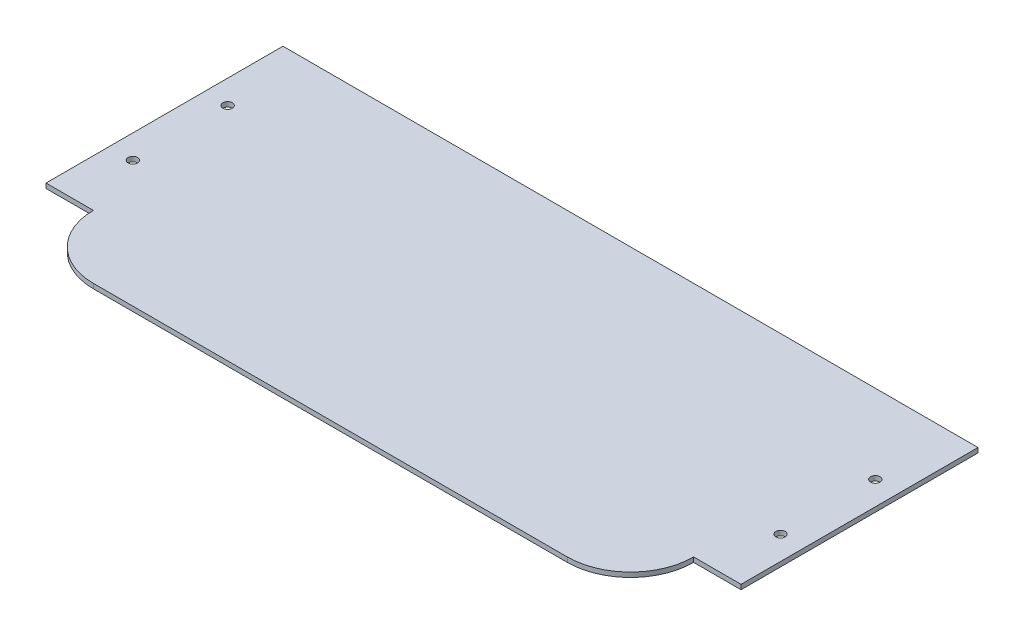
ISO-10303-21;
HEADER;
FILE_DESCRIPTION(('STEP AP214'),'2;1');
FILE_NAME('part.step','',(''),(''),'','','');
FILE_SCHEMA(('AUTOMOTIVE_DESIGN { 1 0 10303 214 1 1 1 1 }'));
ENDSEC;
DATA;
#1=APPLICATION_CONTEXT('core data for automotive mechanical design processes');
#2=APPLICATION_PROTOCOL_DEFINITION('international standard','automotive_design',2000,#1);
#3=PRODUCT_CONTEXT('',#1,'mechanical');
#4=PRODUCT('Part','Part','',(#3));
#5=PRODUCT_RELATED_PRODUCT_CATEGORY('part','',(#4));
#6=PRODUCT_DEFINITION_FORMATION('','',#4);
#7=PRODUCT_DEFINITION_CONTEXT('part definition',#1,'design');
#8=PRODUCT_DEFINITION('design','',#6,#7);
#9=PRODUCT_DEFINITION_SHAPE('','',#8);
#10=(LENGTH_UNIT() NAMED_UNIT(*) SI_UNIT(.MILLI.,.METRE.));
#11=(NAMED_UNIT(*) PLANE_ANGLE_UNIT() SI_UNIT($,.RADIAN.));
#12=(NAMED_UNIT(*) SI_UNIT($,.STERADIAN.) SOLID_ANGLE_UNIT());
#13=UNCERTAINTY_MEASURE_WITH_UNIT(LENGTH_MEASURE(1.E-05),#10,'distance_accuracy_value','');
#14=(GEOMETRIC_REPRESENTATION_CONTEXT(3) GLOBAL_UNCERTAINTY_ASSIGNED_CONTEXT((#13)) GLOBAL_UNIT_ASSIGNED_CONTEXT((#10,
#11,#12)) REPRESENTATION_CONTEXT('',''));
#15=CARTESIAN_POINT('',(0.,0.,0.));
#16=DIRECTION('',(0.,0.,1.));
#17=DIRECTION('',(1.,0.,0.));
#18=AXIS2_PLACEMENT_3D('',#15,#16,#17);
#19=CARTESIAN_POINT('',(-75.,1.5,27.5));
#20=DIRECTION('',(0.,1.,0.));
#21=DIRECTION('',(0.,0.,1.));
#22=AXIS2_PLACEMENT_3D('',#19,#20,#21);
#23=PLANE('',#22);
#24=CARTESIAN_POINT('',(-102.5,1.5,-22.5));
#25=DIRECTION('',(0.,1.,0.));
#26=DIRECTION('',(0.,0.,1.));
#27=AXIS2_PLACEMENT_3D('',#24,#25,#26);
#28=CIRCLE('',#27,1.5);
#29=CARTESIAN_POINT('',(-102.5,1.5,-21.));
#30=VERTEX_POINT('',#29);
#31=EDGE_CURVE('E188',#30,#30,#28,.T.);
#32=ORIENTED_EDGE('',*,*,#31,.F.);
#33=EDGE_LOOP('',(#32));
#34=FACE_BOUND('',#33,.T.);
#35=CARTESIAN_POINT('',(102.5,1.5,-22.5));
#36=DIRECTION('',(0.,1.,0.));
#37=DIRECTION('',(0.,0.,1.));
#38=AXIS2_PLACEMENT_3D('',#35,#36,#37);
#39=CIRCLE('',#38,1.5);
#40=CARTESIAN_POINT('',(102.5,1.5,-21.));
#41=VERTEX_POINT('',#40);
#42=EDGE_CURVE('E134',#41,#41,#39,.T.);
#43=ORIENTED_EDGE('',*,*,#42,.F.);
#44=EDGE_LOOP('',(#43));
#45=FACE_BOUND('',#44,.T.);
#46=DIRECTION('',(0.,0.,1.));
#47=VECTOR('',#46,1.);
#48=CARTESIAN_POINT('',(-110.,1.5,-47.5));
#49=LINE('',#48,#47);
#50=CARTESIAN_POINT('',(-110.,1.5,-47.5));
#51=VERTEX_POINT('',#50);
#52=CARTESIAN_POINT('',(-110.,1.5,27.5));
#53=VERTEX_POINT('',#52);
#54=EDGE_CURVE('E145',#51,#53,#49,.T.);
#55=ORIENTED_EDGE('',*,*,#54,.T.);
#56=DIRECTION('',(1.,0.,0.));
#57=VECTOR('',#56,1.);
#58=CARTESIAN_POINT('',(-110.,1.5,27.5));
#59=LINE('',#58,#57);
#60=CARTESIAN_POINT('',(-95.,1.5,27.5));
#61=VERTEX_POINT('',#60);
#62=EDGE_CURVE('E93',#53,#61,#59,.T.);
#63=ORIENTED_EDGE('',*,*,#62,.T.);
#64=CARTESIAN_POINT('',(-75.,1.5,27.5));
#65=DIRECTION('',(0.,1.,0.));
#66=DIRECTION('',(0.,0.,1.));
#67=AXIS2_PLACEMENT_3D('',#64,#65,#66);
#68=CIRCLE('',#67,20.);
#69=CARTESIAN_POINT('',(-75.,1.5,47.5));
#70=VERTEX_POINT('',#69);
#71=EDGE_CURVE('E160',#61,#70,#68,.T.);
#72=ORIENTED_EDGE('',*,*,#71,.T.);
#73=DIRECTION('',(1.,0.,0.));
#74=VECTOR('',#73,1.);
#75=CARTESIAN_POINT('',(-75.,1.5,47.5));
#76=LINE('',#75,#74);
#77=CARTESIAN_POINT('',(75.,1.5,47.5));
#78=VERTEX_POINT('',#77);
#79=EDGE_CURVE('E173',#70,#78,#76,.T.);
#80=ORIENTED_EDGE('',*,*,#79,.T.);
#81=CARTESIAN_POINT('',(75.,1.5,27.5));
#82=DIRECTION('',(0.,1.,0.));
#83=DIRECTION('',(0.,0.,1.));
#84=AXIS2_PLACEMENT_3D('',#81,#82,#83);
#85=CIRCLE('',#84,20.);
#86=CARTESIAN_POINT('',(95.,1.5,27.5));
#87=VERTEX_POINT('',#86);
#88=EDGE_CURVE('E112',#78,#87,#85,.T.);
#89=ORIENTED_EDGE('',*,*,#88,.T.);
#90=DIRECTION('',(1.,0.,0.));
#91=VECTOR('',#90,1.);
#92=CARTESIAN_POINT('',(95.,1.5,27.5));
#93=LINE('',#92,#91);
#94=CARTESIAN_POINT('',(110.,1.5,27.5));
#95=VERTEX_POINT('',#94);
#96=EDGE_CURVE('E106',#87,#95,#93,.T.);
#97=ORIENTED_EDGE('',*,*,#96,.T.);
#98=DIRECTION('',(0.,0.,-1.));
#99=VECTOR('',#98,1.);
#100=CARTESIAN_POINT('',(110.,1.5,-47.5));
#101=LINE('',#100,#99);
#102=CARTESIAN_POINT('',(110.,1.5,-47.5));
#103=VERTEX_POINT('',#102);
#104=EDGE_CURVE('E110',#95,#103,#101,.T.);
#105=ORIENTED_EDGE('',*,*,#104,.T.);
#106=DIRECTION('',(-1.,0.,0.));
#107=VECTOR('',#106,1.);
#108=CARTESIAN_POINT('',(-110.,1.5,-47.5));
#109=LINE('',#108,#107);
#110=EDGE_CURVE('E50',#103,#51,#109,.T.);
#111=ORIENTED_EDGE('',*,*,#110,.T.);
#112=EDGE_LOOP('',(#55,#63,#72,#80,#89,#97,#105,#111));
#113=FACE_BOUND('',#112,.T.);
#114=CARTESIAN_POINT('',(-102.5,1.5,7.50000000000001));
#115=DIRECTION('',(0.,1.,0.));
#116=DIRECTION('',(0.,0.,1.));
#117=AXIS2_PLACEMENT_3D('',#114,#115,#116);
#118=CIRCLE('',#117,1.5);
#119=CARTESIAN_POINT('',(-102.5,1.5,9.00000000000001));
#120=VERTEX_POINT('',#119);
#121=EDGE_CURVE('E182',#120,#120,#118,.T.);
#122=ORIENTED_EDGE('',*,*,#121,.F.);
#123=EDGE_LOOP('',(#122));
#124=FACE_BOUND('',#123,.T.);
#125=CARTESIAN_POINT('',(102.5,1.5,7.50000000000001));
#126=DIRECTION('',(0.,1.,0.));
#127=DIRECTION('',(0.,0.,1.));
#128=AXIS2_PLACEMENT_3D('',#125,#126,#127);
#129=CIRCLE('',#128,1.5);
#130=CARTESIAN_POINT('',(102.5,1.5,9.00000000000001));
#131=VERTEX_POINT('',#130);
#132=EDGE_CURVE('E194',#131,#131,#129,.T.);
#133=ORIENTED_EDGE('',*,*,#132,.F.);
#134=EDGE_LOOP('',(#133));
#135=FACE_BOUND('',#134,.T.);
#136=ADVANCED_FACE('F33',(#34,#45,#113,#124,#135),#23,.T.);
#137=CARTESIAN_POINT('',(-75.,0.,27.5));
#138=DIRECTION('',(0.,1.,0.));
#139=DIRECTION('',(0.,0.,1.));
#140=AXIS2_PLACEMENT_3D('',#137,#138,#139);
#141=PLANE('',#140);
#142=DIRECTION('',(0.,0.,1.));
#143=VECTOR('',#142,1.);
#144=CARTESIAN_POINT('',(-110.,0.,-47.5));
#145=LINE('',#144,#143);
#146=CARTESIAN_POINT('',(-110.,0.,-47.5));
#147=VERTEX_POINT('',#146);
#148=CARTESIAN_POINT('',(-110.,0.,27.5));
#149=VERTEX_POINT('',#148);
#150=EDGE_CURVE('E130',#147,#149,#145,.T.);
#151=ORIENTED_EDGE('',*,*,#150,.F.);
#152=DIRECTION('',(-1.,0.,0.));
#153=VECTOR('',#152,1.);
#154=CARTESIAN_POINT('',(-110.,0.,-47.5));
#155=LINE('',#154,#153);
#156=CARTESIAN_POINT('',(110.,0.,-47.5));
#157=VERTEX_POINT('',#156);
#158=EDGE_CURVE('E85',#157,#147,#155,.T.);
#159=ORIENTED_EDGE('',*,*,#158,.F.);
#160=DIRECTION('',(0.,0.,-1.));
#161=VECTOR('',#160,1.);
#162=CARTESIAN_POINT('',(110.,0.,-47.5));
#163=LINE('',#162,#161);
#164=CARTESIAN_POINT('',(110.,0.,27.5));
#165=VERTEX_POINT('',#164);
#166=EDGE_CURVE('E79',#165,#157,#163,.T.);
#167=ORIENTED_EDGE('',*,*,#166,.F.);
#168=DIRECTION('',(1.,0.,0.));
#169=VECTOR('',#168,1.);
#170=CARTESIAN_POINT('',(95.,0.,27.5));
#171=LINE('',#170,#169);
#172=CARTESIAN_POINT('',(95.,0.,27.5));
#173=VERTEX_POINT('',#172);
#174=EDGE_CURVE('E120',#173,#165,#171,.T.);
#175=ORIENTED_EDGE('',*,*,#174,.F.);
#176=CARTESIAN_POINT('',(75.,0.,27.5));
#177=DIRECTION('',(0.,1.,0.));
#178=DIRECTION('',(0.,0.,1.));
#179=AXIS2_PLACEMENT_3D('',#176,#177,#178);
#180=CIRCLE('',#179,20.);
#181=CARTESIAN_POINT('',(75.,0.,47.5));
#182=VERTEX_POINT('',#181);
#183=EDGE_CURVE('E140',#182,#173,#180,.T.);
#184=ORIENTED_EDGE('',*,*,#183,.F.);
#185=DIRECTION('',(1.,0.,0.));
#186=VECTOR('',#185,1.);
#187=CARTESIAN_POINT('',(-75.,0.,47.5));
#188=LINE('',#187,#186);
#189=CARTESIAN_POINT('',(-75.,0.,47.5));
#190=VERTEX_POINT('',#189);
#191=EDGE_CURVE('E138',#190,#182,#188,.T.);
#192=ORIENTED_EDGE('',*,*,#191,.F.);
#193=CARTESIAN_POINT('',(-75.,0.,27.5));
#194=DIRECTION('',(0.,1.,0.));
#195=DIRECTION('',(0.,0.,1.));
#196=AXIS2_PLACEMENT_3D('',#193,#194,#195);
#197=CIRCLE('',#196,20.);
#198=CARTESIAN_POINT('',(-95.,0.,27.5));
#199=VERTEX_POINT('',#198);
#200=EDGE_CURVE('E136',#199,#190,#197,.T.);
#201=ORIENTED_EDGE('',*,*,#200,.F.);
#202=DIRECTION('',(1.,0.,0.));
#203=VECTOR('',#202,1.);
#204=CARTESIAN_POINT('',(-110.,0.,27.5));
#205=LINE('',#204,#203);
#206=EDGE_CURVE('E133',#149,#199,#205,.T.);
#207=ORIENTED_EDGE('',*,*,#206,.F.);
#208=EDGE_LOOP('',(#151,#159,#167,#175,#184,#192,#201,#207));
#209=FACE_BOUND('',#208,.T.);
#210=CARTESIAN_POINT('',(102.5,0.,-22.5));
#211=DIRECTION('',(0.,1.,0.));
#212=DIRECTION('',(0.,0.,1.));
#213=AXIS2_PLACEMENT_3D('',#210,#211,#212);
#214=CIRCLE('',#213,1.5);
#215=CARTESIAN_POINT('',(102.5,0.,-21.));
#216=VERTEX_POINT('',#215);
#217=EDGE_CURVE('E179',#216,#216,#214,.T.);
#218=ORIENTED_EDGE('',*,*,#217,.T.);
#219=EDGE_LOOP('',(#218));
#220=FACE_BOUND('',#219,.T.);
#221=CARTESIAN_POINT('',(-102.5,0.,7.50000000000001));
#222=DIRECTION('',(0.,1.,0.));
#223=DIRECTION('',(0.,0.,1.));
#224=AXIS2_PLACEMENT_3D('',#221,#222,#223);
#225=CIRCLE('',#224,1.5);
#226=CARTESIAN_POINT('',(-102.5,0.,9.00000000000001));
#227=VERTEX_POINT('',#226);
#228=EDGE_CURVE('E185',#227,#227,#225,.T.);
#229=ORIENTED_EDGE('',*,*,#228,.T.);
#230=EDGE_LOOP('',(#229));
#231=FACE_BOUND('',#230,.T.);
#232=CARTESIAN_POINT('',(-102.5,0.,-22.5));
#233=DIRECTION('',(0.,1.,0.));
#234=DIRECTION('',(0.,0.,1.));
#235=AXIS2_PLACEMENT_3D('',#232,#233,#234);
#236=CIRCLE('',#235,1.5);
#237=CARTESIAN_POINT('',(-102.5,0.,-21.));
#238=VERTEX_POINT('',#237);
#239=EDGE_CURVE('E191',#238,#238,#236,.T.);
#240=ORIENTED_EDGE('',*,*,#239,.T.);
#241=EDGE_LOOP('',(#240));
#242=FACE_BOUND('',#241,.T.);
#243=CARTESIAN_POINT('',(102.5,0.,7.50000000000001));
#244=DIRECTION('',(0.,1.,0.));
#245=DIRECTION('',(0.,0.,1.));
#246=AXIS2_PLACEMENT_3D('',#243,#244,#245);
#247=CIRCLE('',#246,1.5);
#248=CARTESIAN_POINT('',(102.5,0.,9.00000000000001));
#249=VERTEX_POINT('',#248);
#250=EDGE_CURVE('E197',#249,#249,#247,.T.);
#251=ORIENTED_EDGE('',*,*,#250,.T.);
#252=EDGE_LOOP('',(#251));
#253=FACE_BOUND('',#252,.T.);
#254=ADVANCED_FACE('F164',(#209,#220,#231,#242,#253),#141,.F.);
#255=CARTESIAN_POINT('',(-110.,1.5,-47.5));
#256=DIRECTION('',(1.,0.,0.));
#257=DIRECTION('',(0.,0.,-1.));
#258=AXIS2_PLACEMENT_3D('',#255,#256,#257);
#259=PLANE('',#258);
#260=ORIENTED_EDGE('',*,*,#150,.T.);
#261=DIRECTION('',(0.,-1.,0.));
#262=VECTOR('',#261,1.);
#263=CARTESIAN_POINT('',(-110.,1.5,27.5));
#264=LINE('',#263,#262);
#265=EDGE_CURVE('E11',#53,#149,#264,.T.);
#266=ORIENTED_EDGE('',*,*,#265,.F.);
#267=ORIENTED_EDGE('',*,*,#54,.F.);
#268=DIRECTION('',(0.,-1.,0.));
#269=VECTOR('',#268,1.);
#270=CARTESIAN_POINT('',(-110.,1.5,-47.5));
#271=LINE('',#270,#269);
#272=EDGE_CURVE('E126',#51,#147,#271,.T.);
#273=ORIENTED_EDGE('',*,*,#272,.T.);
#274=EDGE_LOOP('',(#260,#266,#267,#273));
#275=FACE_BOUND('',#274,.T.);
#276=ADVANCED_FACE('F35',(#275),#259,.F.);
#277=CARTESIAN_POINT('',(-110.,1.5,27.5));
#278=DIRECTION('',(0.,0.,-1.));
#279=DIRECTION('',(-1.,0.,0.));
#280=AXIS2_PLACEMENT_3D('',#277,#278,#279);
#281=PLANE('',#280);
#282=ORIENTED_EDGE('',*,*,#206,.T.);
#283=DIRECTION('',(0.,-1.,0.));
#284=VECTOR('',#283,1.);
#285=CARTESIAN_POINT('',(-95.,1.5,27.5));
#286=LINE('',#285,#284);
#287=EDGE_CURVE('E42',#61,#199,#286,.T.);
#288=ORIENTED_EDGE('',*,*,#287,.F.);
#289=ORIENTED_EDGE('',*,*,#62,.F.);
#290=ORIENTED_EDGE('',*,*,#265,.T.);
#291=EDGE_LOOP('',(#282,#288,#289,#290));
#292=FACE_BOUND('',#291,.T.);
#293=ADVANCED_FACE('F231',(#292),#281,.F.);
#294=CARTESIAN_POINT('',(-75.,1.5,27.5));
#295=DIRECTION('',(0.,-1.,0.));
#296=DIRECTION('',(0.,0.,-1.));
#297=AXIS2_PLACEMENT_3D('',#294,#295,#296);
#298=CYLINDRICAL_SURFACE('',#297,20.);
#299=ORIENTED_EDGE('',*,*,#200,.T.);
#300=DIRECTION('',(0.,-1.,0.));
#301=VECTOR('',#300,1.);
#302=CARTESIAN_POINT('',(-75.,1.5,47.5));
#303=LINE('',#302,#301);
#304=EDGE_CURVE('E152',#70,#190,#303,.T.);
#305=ORIENTED_EDGE('',*,*,#304,.F.);
#306=ORIENTED_EDGE('',*,*,#71,.F.);
#307=ORIENTED_EDGE('',*,*,#287,.T.);
#308=EDGE_LOOP('',(#299,#305,#306,#307));
#309=FACE_BOUND('',#308,.T.);
#310=ADVANCED_FACE('F158',(#309),#298,.T.);
#311=CARTESIAN_POINT('',(-75.,1.5,47.5));
#312=DIRECTION('',(0.,0.,-1.));
#313=DIRECTION('',(-1.,0.,0.));
#314=AXIS2_PLACEMENT_3D('',#311,#312,#313);
#315=PLANE('',#314);
#316=ORIENTED_EDGE('',*,*,#191,.T.);
#317=DIRECTION('',(0.,-1.,0.));
#318=VECTOR('',#317,1.);
#319=CARTESIAN_POINT('',(75.,1.5,47.5));
#320=LINE('',#319,#318);
#321=EDGE_CURVE('E149',#78,#182,#320,.T.);
#322=ORIENTED_EDGE('',*,*,#321,.F.);
#323=ORIENTED_EDGE('',*,*,#79,.F.);
#324=ORIENTED_EDGE('',*,*,#304,.T.);
#325=EDGE_LOOP('',(#316,#322,#323,#324));
#326=FACE_BOUND('',#325,.T.);
#327=ADVANCED_FACE('F169',(#326),#315,.F.);
#328=CARTESIAN_POINT('',(75.,1.5,27.5));
#329=DIRECTION('',(0.,-1.,0.));
#330=DIRECTION('',(0.,0.,-1.));
#331=AXIS2_PLACEMENT_3D('',#328,#329,#330);
#332=CYLINDRICAL_SURFACE('',#331,20.);
#333=ORIENTED_EDGE('',*,*,#183,.T.);
#334=DIRECTION('',(0.,-1.,0.));
#335=VECTOR('',#334,1.);
#336=CARTESIAN_POINT('',(95.,1.5,27.5));
#337=LINE('',#336,#335);
#338=EDGE_CURVE('E121',#87,#173,#337,.T.);
#339=ORIENTED_EDGE('',*,*,#338,.F.);
#340=ORIENTED_EDGE('',*,*,#88,.F.);
#341=ORIENTED_EDGE('',*,*,#321,.T.);
#342=EDGE_LOOP('',(#333,#339,#340,#341));
#343=FACE_BOUND('',#342,.T.);
#344=ADVANCED_FACE('F172',(#343),#332,.T.);
#345=CARTESIAN_POINT('',(95.,1.5,27.5));
#346=DIRECTION('',(0.,0.,-1.));
#347=DIRECTION('',(-1.,0.,0.));
#348=AXIS2_PLACEMENT_3D('',#345,#346,#347);
#349=PLANE('',#348);
#350=ORIENTED_EDGE('',*,*,#174,.T.);
#351=DIRECTION('',(0.,-1.,0.));
#352=VECTOR('',#351,1.);
#353=CARTESIAN_POINT('',(110.,1.5,27.5));
#354=LINE('',#353,#352);
#355=EDGE_CURVE('E117',#95,#165,#354,.T.);
#356=ORIENTED_EDGE('',*,*,#355,.F.);
#357=ORIENTED_EDGE('',*,*,#96,.F.);
#358=ORIENTED_EDGE('',*,*,#338,.T.);
#359=EDGE_LOOP('',(#350,#356,#357,#358));
#360=FACE_BOUND('',#359,.T.);
#361=ADVANCED_FACE('F118',(#360),#349,.F.);
#362=CARTESIAN_POINT('',(110.,1.5,-47.5));
#363=DIRECTION('',(-1.,0.,0.));
#364=DIRECTION('',(0.,0.,1.));
#365=AXIS2_PLACEMENT_3D('',#362,#363,#364);
#366=PLANE('',#365);
#367=ORIENTED_EDGE('',*,*,#166,.T.);
#368=DIRECTION('',(0.,-1.,0.));
#369=VECTOR('',#368,1.);
#370=CARTESIAN_POINT('',(110.,1.5,-47.5));
#371=LINE('',#370,#369);
#372=EDGE_CURVE('E122',#103,#157,#371,.T.);
#373=ORIENTED_EDGE('',*,*,#372,.F.);
#374=ORIENTED_EDGE('',*,*,#104,.F.);
#375=ORIENTED_EDGE('',*,*,#355,.T.);
#376=EDGE_LOOP('',(#367,#373,#374,#375));
#377=FACE_BOUND('',#376,.T.);
#378=ADVANCED_FACE('F124',(#377),#366,.F.);
#379=CARTESIAN_POINT('',(-110.,1.5,-47.5));
#380=DIRECTION('',(0.,0.,1.));
#381=DIRECTION('',(1.,0.,0.));
#382=AXIS2_PLACEMENT_3D('',#379,#380,#381);
#383=PLANE('',#382);
#384=ORIENTED_EDGE('',*,*,#158,.T.);
#385=ORIENTED_EDGE('',*,*,#272,.F.);
#386=ORIENTED_EDGE('',*,*,#110,.F.);
#387=ORIENTED_EDGE('',*,*,#372,.T.);
#388=EDGE_LOOP('',(#384,#385,#386,#387));
#389=FACE_BOUND('',#388,.T.);
#390=ADVANCED_FACE('F219',(#389),#383,.F.);
#391=CARTESIAN_POINT('',(102.5,1.5,-22.5));
#392=DIRECTION('',(0.,-1.,0.));
#393=DIRECTION('',(0.,0.,-1.));
#394=AXIS2_PLACEMENT_3D('',#391,#392,#393);
#395=CYLINDRICAL_SURFACE('',#394,1.5);
#396=ORIENTED_EDGE('',*,*,#42,.T.);
#397=EDGE_LOOP('',(#396));
#398=FACE_BOUND('',#397,.T.);
#399=ORIENTED_EDGE('',*,*,#217,.F.);
#400=EDGE_LOOP('',(#399));
#401=FACE_BOUND('',#400,.T.);
#402=ADVANCED_FACE('F216',(#398,#401),#395,.F.);
#403=CARTESIAN_POINT('',(-102.5,1.5,7.50000000000001));
#404=DIRECTION('',(0.,-1.,0.));
#405=DIRECTION('',(0.,0.,-1.));
#406=AXIS2_PLACEMENT_3D('',#403,#404,#405);
#407=CYLINDRICAL_SURFACE('',#406,1.5);
#408=ORIENTED_EDGE('',*,*,#121,.T.);
#409=EDGE_LOOP('',(#408));
#410=FACE_BOUND('',#409,.T.);
#411=ORIENTED_EDGE('',*,*,#228,.F.);
#412=EDGE_LOOP('',(#411));
#413=FACE_BOUND('',#412,.T.);
#414=ADVANCED_FACE('F295',(#410,#413),#407,.F.);
#415=CARTESIAN_POINT('',(-102.5,1.5,-22.5));
#416=DIRECTION('',(0.,-1.,0.));
#417=DIRECTION('',(0.,0.,-1.));
#418=AXIS2_PLACEMENT_3D('',#415,#416,#417);
#419=CYLINDRICAL_SURFACE('',#418,1.5);
#420=ORIENTED_EDGE('',*,*,#31,.T.);
#421=EDGE_LOOP('',(#420));
#422=FACE_BOUND('',#421,.T.);
#423=ORIENTED_EDGE('',*,*,#239,.F.);
#424=EDGE_LOOP('',(#423));
#425=FACE_BOUND('',#424,.T.);
#426=ADVANCED_FACE('F303',(#422,#425),#419,.F.);
#427=CARTESIAN_POINT('',(102.5,1.5,7.50000000000001));
#428=DIRECTION('',(0.,-1.,0.));
#429=DIRECTION('',(0.,0.,-1.));
#430=AXIS2_PLACEMENT_3D('',#427,#428,#429);
#431=CYLINDRICAL_SURFACE('',#430,1.5);
#432=ORIENTED_EDGE('',*,*,#132,.T.);
#433=EDGE_LOOP('',(#432));
#434=FACE_BOUND('',#433,.T.);
#435=ORIENTED_EDGE('',*,*,#250,.F.);
#436=EDGE_LOOP('',(#435));
#437=FACE_BOUND('',#436,.T.);
#438=ADVANCED_FACE('F203',(#434,#437),#431,.F.);
#439=CLOSED_SHELL('',(#136,#254,#276,#293,#310,#327,#344,#361,#378,#390,#402,#414,#426,#438));
#440=MANIFOLD_SOLID_BREP('B2',#439);
#441=ADVANCED_BREP_SHAPE_REPRESENTATION('',(#18,#440),#14);
#442=SHAPE_DEFINITION_REPRESENTATION(#9,#441);
ENDSEC;
END-ISO-10303-21;
